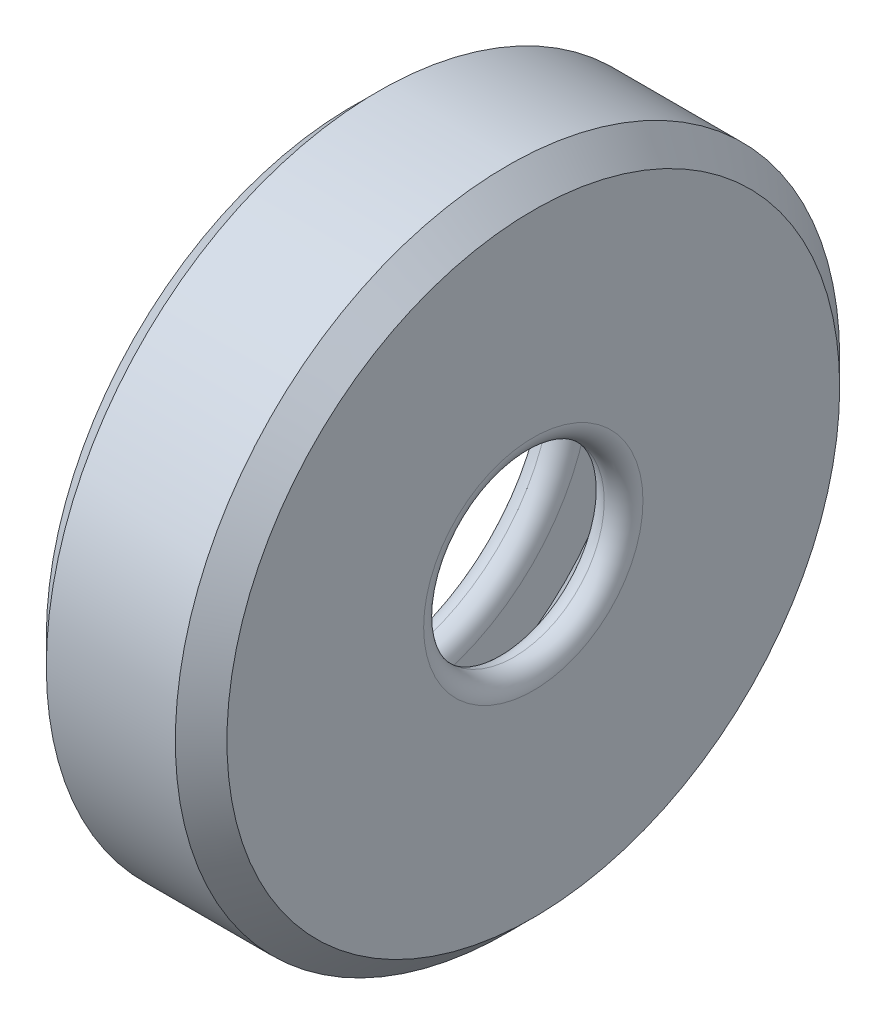
ISO-10303-21;
HEADER;
FILE_DESCRIPTION(('STEP AP214'),'2;1');
FILE_NAME('part.step','',(''),(''),'','','');
FILE_SCHEMA(('AUTOMOTIVE_DESIGN { 1 0 10303 214 1 1 1 1 }'));
ENDSEC;
DATA;
#1=APPLICATION_CONTEXT('core data for automotive mechanical design processes');
#2=APPLICATION_PROTOCOL_DEFINITION('international standard','automotive_design',2000,#1);
#3=PRODUCT_CONTEXT('',#1,'mechanical');
#4=PRODUCT('Part','Part','',(#3));
#5=PRODUCT_RELATED_PRODUCT_CATEGORY('part','',(#4));
#6=PRODUCT_DEFINITION_FORMATION('','',#4);
#7=PRODUCT_DEFINITION_CONTEXT('part definition',#1,'design');
#8=PRODUCT_DEFINITION('design','',#6,#7);
#9=PRODUCT_DEFINITION_SHAPE('','',#8);
#10=(LENGTH_UNIT() NAMED_UNIT(*) SI_UNIT(.MILLI.,.METRE.));
#11=(NAMED_UNIT(*) PLANE_ANGLE_UNIT() SI_UNIT($,.RADIAN.));
#12=(NAMED_UNIT(*) SI_UNIT($,.STERADIAN.) SOLID_ANGLE_UNIT());
#13=UNCERTAINTY_MEASURE_WITH_UNIT(LENGTH_MEASURE(1.E-05),#10,'distance_accuracy_value','');
#14=(GEOMETRIC_REPRESENTATION_CONTEXT(3) GLOBAL_UNCERTAINTY_ASSIGNED_CONTEXT((#13)) GLOBAL_UNIT_ASSIGNED_CONTEXT((#10,
#11,#12)) REPRESENTATION_CONTEXT('',''));
#15=CARTESIAN_POINT('',(0.,0.,0.));
#16=DIRECTION('',(0.,0.,1.));
#17=DIRECTION('',(1.,0.,0.));
#18=AXIS2_PLACEMENT_3D('',#15,#16,#17);
#19=CARTESIAN_POINT('',(-7.,14.,0.));
#20=DIRECTION('',(-1.,0.,0.));
#21=DIRECTION('',(0.,0.,1.));
#22=AXIS2_PLACEMENT_3D('',#19,#20,#21);
#23=PLANE('',#22);
#24=CARTESIAN_POINT('',(-7.,0.,0.));
#25=DIRECTION('',(-1.,0.,0.));
#26=DIRECTION('',(0.,0.,1.));
#27=AXIS2_PLACEMENT_3D('',#24,#25,#26);
#28=CIRCLE('',#27,15.5);
#29=CARTESIAN_POINT('',(-7.,0.,15.5));
#30=VERTEX_POINT('',#29);
#31=EDGE_CURVE('E38',#30,#30,#28,.F.);
#32=ORIENTED_EDGE('',*,*,#31,.T.);
#33=EDGE_LOOP('',(#32));
#34=FACE_BOUND('',#33,.T.);
#35=CARTESIAN_POINT('',(-7.,0.,0.));
#36=DIRECTION('',(-1.,0.,0.));
#37=DIRECTION('',(0.,0.,1.));
#38=AXIS2_PLACEMENT_3D('',#35,#36,#37);
#39=CIRCLE('',#38,23.75);
#40=CARTESIAN_POINT('',(-7.,0.,23.75));
#41=VERTEX_POINT('',#40);
#42=EDGE_CURVE('E114',#41,#41,#39,.T.);
#43=ORIENTED_EDGE('',*,*,#42,.T.);
#44=EDGE_LOOP('',(#43));
#45=FACE_BOUND('',#44,.T.);
#46=ADVANCED_FACE('F30',(#34,#45),#23,.T.);
#47=CARTESIAN_POINT('',(0.,0.,0.));
#48=DIRECTION('',(1.,0.,0.));
#49=DIRECTION('',(0.,0.,-1.));
#50=AXIS2_PLACEMENT_3D('',#47,#48,#49);
#51=CYLINDRICAL_SURFACE('',#50,25.75);
#52=CARTESIAN_POINT('',(-5.,0.,0.));
#53=DIRECTION('',(-1.,0.,0.));
#54=DIRECTION('',(0.,0.,1.));
#55=AXIS2_PLACEMENT_3D('',#52,#53,#54);
#56=CIRCLE('',#55,25.75);
#57=CARTESIAN_POINT('',(-5.,0.,25.75));
#58=VERTEX_POINT('',#57);
#59=EDGE_CURVE('E117',#58,#58,#56,.F.);
#60=ORIENTED_EDGE('',*,*,#59,.T.);
#61=EDGE_LOOP('',(#60));
#62=FACE_BOUND('',#61,.T.);
#63=CARTESIAN_POINT('',(4.99999999999999,0.,0.));
#64=DIRECTION('',(1.,0.,0.));
#65=DIRECTION('',(0.,0.,-1.));
#66=AXIS2_PLACEMENT_3D('',#63,#64,#65);
#67=CIRCLE('',#66,25.75);
#68=CARTESIAN_POINT('',(4.99999999999999,0.,-25.75));
#69=VERTEX_POINT('',#68);
#70=EDGE_CURVE('E120',#69,#69,#67,.F.);
#71=ORIENTED_EDGE('',*,*,#70,.T.);
#72=EDGE_LOOP('',(#71));
#73=FACE_BOUND('',#72,.T.);
#74=ADVANCED_FACE('F70',(#62,#73),#51,.T.);
#75=CARTESIAN_POINT('',(7.,7.,0.));
#76=DIRECTION('',(1.,0.,0.));
#77=DIRECTION('',(0.,0.,-1.));
#78=AXIS2_PLACEMENT_3D('',#75,#76,#77);
#79=PLANE('',#78);
#80=CARTESIAN_POINT('',(7.,0.,0.));
#81=DIRECTION('',(1.,0.,0.));
#82=DIRECTION('',(0.,0.,-1.));
#83=AXIS2_PLACEMENT_3D('',#80,#81,#82);
#84=CIRCLE('',#83,8.5);
#85=CARTESIAN_POINT('',(7.,0.,-8.5));
#86=VERTEX_POINT('',#85);
#87=EDGE_CURVE('E43',#86,#86,#84,.F.);
#88=ORIENTED_EDGE('',*,*,#87,.T.);
#89=EDGE_LOOP('',(#88));
#90=FACE_BOUND('',#89,.T.);
#91=CARTESIAN_POINT('',(7.,0.,0.));
#92=DIRECTION('',(1.,0.,0.));
#93=DIRECTION('',(0.,0.,-1.));
#94=AXIS2_PLACEMENT_3D('',#91,#92,#93);
#95=CIRCLE('',#94,23.75);
#96=CARTESIAN_POINT('',(7.,0.,-23.75));
#97=VERTEX_POINT('',#96);
#98=EDGE_CURVE('E109',#97,#97,#95,.T.);
#99=ORIENTED_EDGE('',*,*,#98,.T.);
#100=EDGE_LOOP('',(#99));
#101=FACE_BOUND('',#100,.T.);
#102=ADVANCED_FACE('F76',(#90,#101),#79,.T.);
#103=CARTESIAN_POINT('',(4.,14.,0.));
#104=DIRECTION('',(-1.,0.,0.));
#105=DIRECTION('',(0.,0.,1.));
#106=AXIS2_PLACEMENT_3D('',#103,#104,#105);
#107=PLANE('',#106);
#108=CARTESIAN_POINT('',(4.,0.,0.));
#109=DIRECTION('',(-1.,0.,0.));
#110=DIRECTION('',(0.,0.,1.));
#111=AXIS2_PLACEMENT_3D('',#108,#109,#110);
#112=CIRCLE('',#111,8.5);
#113=CARTESIAN_POINT('',(4.,0.,8.5));
#114=VERTEX_POINT('',#113);
#115=EDGE_CURVE('E107',#114,#114,#112,.F.);
#116=ORIENTED_EDGE('',*,*,#115,.T.);
#117=EDGE_LOOP('',(#116));
#118=FACE_BOUND('',#117,.T.);
#119=CARTESIAN_POINT('',(4.,0.,0.));
#120=DIRECTION('',(-1.,0.,0.));
#121=DIRECTION('',(0.,0.,1.));
#122=AXIS2_PLACEMENT_3D('',#119,#120,#121);
#123=CIRCLE('',#122,19.);
#124=CARTESIAN_POINT('',(4.,0.,19.));
#125=VERTEX_POINT('',#124);
#126=EDGE_CURVE('E123',#125,#125,#123,.T.);
#127=ORIENTED_EDGE('',*,*,#126,.T.);
#128=EDGE_LOOP('',(#127));
#129=FACE_BOUND('',#128,.T.);
#130=ADVANCED_FACE('F135',(#118,#129),#107,.T.);
#131=CARTESIAN_POINT('',(0.,0.,0.));
#132=DIRECTION('',(1.,0.,0.));
#133=DIRECTION('',(0.,0.,-1.));
#134=AXIS2_PLACEMENT_3D('',#131,#132,#133);
#135=CYLINDRICAL_SURFACE('',#134,21.);
#136=CARTESIAN_POINT('',(-2.,0.,0.));
#137=DIRECTION('',(1.,0.,0.));
#138=DIRECTION('',(0.,0.,-1.));
#139=AXIS2_PLACEMENT_3D('',#136,#137,#138);
#140=CIRCLE('',#139,21.);
#141=CARTESIAN_POINT('',(-2.,0.,-21.));
#142=VERTEX_POINT('',#141);
#143=EDGE_CURVE('E126',#142,#142,#140,.F.);
#144=ORIENTED_EDGE('',*,*,#143,.T.);
#145=EDGE_LOOP('',(#144));
#146=FACE_BOUND('',#145,.T.);
#147=CARTESIAN_POINT('',(1.99999999999999,0.,0.));
#148=DIRECTION('',(-1.,0.,0.));
#149=DIRECTION('',(0.,0.,1.));
#150=AXIS2_PLACEMENT_3D('',#147,#148,#149);
#151=CIRCLE('',#150,21.);
#152=CARTESIAN_POINT('',(1.99999999999999,0.,21.));
#153=VERTEX_POINT('',#152);
#154=EDGE_CURVE('E52',#153,#153,#151,.F.);
#155=ORIENTED_EDGE('',*,*,#154,.T.);
#156=EDGE_LOOP('',(#155));
#157=FACE_BOUND('',#156,.T.);
#158=ADVANCED_FACE('F132',(#146,#157),#135,.F.);
#159=CARTESIAN_POINT('',(-4.,21.,0.));
#160=DIRECTION('',(1.,0.,0.));
#161=DIRECTION('',(0.,0.,-1.));
#162=AXIS2_PLACEMENT_3D('',#159,#160,#161);
#163=PLANE('',#162);
#164=CARTESIAN_POINT('',(-4.,0.,0.));
#165=DIRECTION('',(1.,0.,0.));
#166=DIRECTION('',(0.,0.,-1.));
#167=AXIS2_PLACEMENT_3D('',#164,#165,#166);
#168=CIRCLE('',#167,15.5);
#169=CARTESIAN_POINT('',(-4.,0.,-15.5));
#170=VERTEX_POINT('',#169);
#171=EDGE_CURVE('E10',#170,#170,#168,.F.);
#172=ORIENTED_EDGE('',*,*,#171,.T.);
#173=EDGE_LOOP('',(#172));
#174=FACE_BOUND('',#173,.T.);
#175=CARTESIAN_POINT('',(-4.,0.,0.));
#176=DIRECTION('',(1.,0.,0.));
#177=DIRECTION('',(0.,0.,-1.));
#178=AXIS2_PLACEMENT_3D('',#175,#176,#177);
#179=CIRCLE('',#178,19.);
#180=CARTESIAN_POINT('',(-4.,0.,-19.));
#181=VERTEX_POINT('',#180);
#182=EDGE_CURVE('E48',#181,#181,#179,.T.);
#183=ORIENTED_EDGE('',*,*,#182,.T.);
#184=EDGE_LOOP('',(#183));
#185=FACE_BOUND('',#184,.T.);
#186=ADVANCED_FACE('F86',(#174,#185),#163,.T.);
#187=CARTESIAN_POINT('',(-4.,0.,0.));
#188=DIRECTION('',(1.,0.,0.));
#189=DIRECTION('',(0.,0.,-1.));
#190=AXIS2_PLACEMENT_3D('',#187,#188,#189);
#191=CONICAL_SURFACE('',#190,19.,0.785398163397455);
#192=ORIENTED_EDGE('',*,*,#143,.F.);
#193=EDGE_LOOP('',(#192));
#194=FACE_BOUND('',#193,.T.);
#195=ORIENTED_EDGE('',*,*,#182,.F.);
#196=EDGE_LOOP('',(#195));
#197=FACE_BOUND('',#196,.T.);
#198=ADVANCED_FACE('F82',(#194,#197),#191,.F.);
#199=CARTESIAN_POINT('',(1.99999999999999,0.,0.));
#200=DIRECTION('',(-1.,0.,0.));
#201=DIRECTION('',(0.,0.,1.));
#202=AXIS2_PLACEMENT_3D('',#199,#200,#201);
#203=CONICAL_SURFACE('',#202,21.,0.785398163397443);
#204=ORIENTED_EDGE('',*,*,#126,.F.);
#205=EDGE_LOOP('',(#204));
#206=FACE_BOUND('',#205,.T.);
#207=ORIENTED_EDGE('',*,*,#154,.F.);
#208=EDGE_LOOP('',(#207));
#209=FACE_BOUND('',#208,.T.);
#210=ADVANCED_FACE('F85',(#206,#209),#203,.F.);
#211=CARTESIAN_POINT('',(-5.,0.,0.));
#212=DIRECTION('',(1.,0.,0.));
#213=DIRECTION('',(0.,0.,-1.));
#214=AXIS2_PLACEMENT_3D('',#211,#212,#213);
#215=CONICAL_SURFACE('',#214,25.75,0.78539816339745);
#216=ORIENTED_EDGE('',*,*,#42,.F.);
#217=EDGE_LOOP('',(#216));
#218=FACE_BOUND('',#217,.T.);
#219=ORIENTED_EDGE('',*,*,#59,.F.);
#220=EDGE_LOOP('',(#219));
#221=FACE_BOUND('',#220,.T.);
#222=ADVANCED_FACE('F90',(#218,#221),#215,.T.);
#223=CARTESIAN_POINT('',(7.,0.,0.));
#224=DIRECTION('',(-1.,0.,0.));
#225=DIRECTION('',(0.,0.,1.));
#226=AXIS2_PLACEMENT_3D('',#223,#224,#225);
#227=CONICAL_SURFACE('',#226,23.75,0.785398163397445);
#228=ORIENTED_EDGE('',*,*,#70,.F.);
#229=EDGE_LOOP('',(#228));
#230=FACE_BOUND('',#229,.T.);
#231=ORIENTED_EDGE('',*,*,#98,.F.);
#232=EDGE_LOOP('',(#231));
#233=FACE_BOUND('',#232,.T.);
#234=ADVANCED_FACE('F94',(#230,#233),#227,.T.);
#235=CARTESIAN_POINT('',(5.5,0.,0.));
#236=DIRECTION('',(1.,0.,0.));
#237=DIRECTION('',(0.,0.,-1.));
#238=AXIS2_PLACEMENT_3D('',#235,#236,#237);
#239=TOROIDAL_SURFACE('',#238,8.5,1.5);
#240=ORIENTED_EDGE('',*,*,#87,.F.);
#241=EDGE_LOOP('',(#240));
#242=FACE_BOUND('',#241,.T.);
#243=CARTESIAN_POINT('',(5.5,0.,0.));
#244=DIRECTION('',(1.,0.,0.));
#245=DIRECTION('',(0.,0.,-1.));
#246=AXIS2_PLACEMENT_3D('',#243,#244,#245);
#247=CIRCLE('',#246,7.);
#248=CARTESIAN_POINT('',(5.5,0.,-7.));
#249=VERTEX_POINT('',#248);
#250=EDGE_CURVE('E46',#249,#249,#247,.T.);
#251=ORIENTED_EDGE('',*,*,#250,.F.);
#252=EDGE_LOOP('',(#251));
#253=FACE_BOUND('',#252,.T.);
#254=ADVANCED_FACE('F67',(#242,#253),#239,.T.);
#255=CARTESIAN_POINT('',(5.5,0.,0.));
#256=DIRECTION('',(-1.,0.,0.));
#257=DIRECTION('',(0.,0.,1.));
#258=AXIS2_PLACEMENT_3D('',#255,#256,#257);
#259=TOROIDAL_SURFACE('',#258,8.5,1.5);
#260=ORIENTED_EDGE('',*,*,#250,.T.);
#261=EDGE_LOOP('',(#260));
#262=FACE_BOUND('',#261,.T.);
#263=ORIENTED_EDGE('',*,*,#115,.F.);
#264=EDGE_LOOP('',(#263));
#265=FACE_BOUND('',#264,.T.);
#266=ADVANCED_FACE('F61',(#262,#265),#259,.T.);
#267=CARTESIAN_POINT('',(-5.5,0.,0.));
#268=DIRECTION('',(1.,0.,0.));
#269=DIRECTION('',(0.,0.,-1.));
#270=AXIS2_PLACEMENT_3D('',#267,#268,#269);
#271=TOROIDAL_SURFACE('',#270,15.5,1.5);
#272=ORIENTED_EDGE('',*,*,#171,.F.);
#273=EDGE_LOOP('',(#272));
#274=FACE_BOUND('',#273,.T.);
#275=CARTESIAN_POINT('',(-5.5,0.,0.));
#276=DIRECTION('',(1.,0.,0.));
#277=DIRECTION('',(0.,0.,-1.));
#278=AXIS2_PLACEMENT_3D('',#275,#276,#277);
#279=CIRCLE('',#278,14.);
#280=CARTESIAN_POINT('',(-5.5,0.,-14.));
#281=VERTEX_POINT('',#280);
#282=EDGE_CURVE('E34',#281,#281,#279,.T.);
#283=ORIENTED_EDGE('',*,*,#282,.F.);
#284=EDGE_LOOP('',(#283));
#285=FACE_BOUND('',#284,.T.);
#286=ADVANCED_FACE('F32',(#274,#285),#271,.T.);
#287=CARTESIAN_POINT('',(-5.5,0.,0.));
#288=DIRECTION('',(-1.,0.,0.));
#289=DIRECTION('',(0.,0.,1.));
#290=AXIS2_PLACEMENT_3D('',#287,#288,#289);
#291=TOROIDAL_SURFACE('',#290,15.5,1.5);
#292=ORIENTED_EDGE('',*,*,#282,.T.);
#293=EDGE_LOOP('',(#292));
#294=FACE_BOUND('',#293,.T.);
#295=ORIENTED_EDGE('',*,*,#31,.F.);
#296=EDGE_LOOP('',(#295));
#297=FACE_BOUND('',#296,.T.);
#298=ADVANCED_FACE('F57',(#294,#297),#291,.T.);
#299=CLOSED_SHELL('',(#46,#74,#102,#130,#158,#186,#198,#210,#222,#234,#254,#266,#286,#298));
#300=MANIFOLD_SOLID_BREP('B2',#299);
#301=ADVANCED_BREP_SHAPE_REPRESENTATION('',(#18,#300),#14);
#302=SHAPE_DEFINITION_REPRESENTATION(#9,#301);
ENDSEC;
END-ISO-10303-21;
